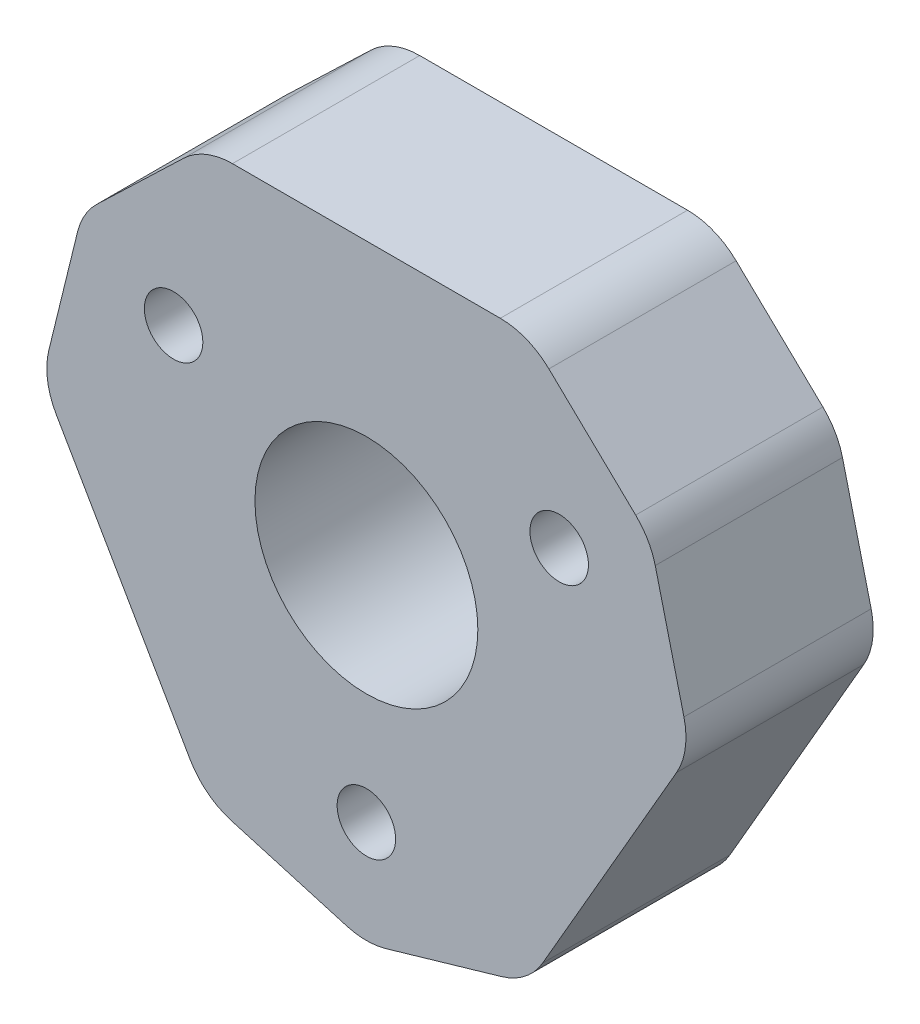
ISO-10303-21;
HEADER;
FILE_DESCRIPTION(('STEP AP214'),'2;1');
FILE_NAME('part.step','',(''),(''),'','','');
FILE_SCHEMA(('AUTOMOTIVE_DESIGN { 1 0 10303 214 1 1 1 1 }'));
ENDSEC;
DATA;
#1=APPLICATION_CONTEXT('core data for automotive mechanical design processes');
#2=APPLICATION_PROTOCOL_DEFINITION('international standard','automotive_design',2000,#1);
#3=PRODUCT_CONTEXT('',#1,'mechanical');
#4=PRODUCT('Part','Part','',(#3));
#5=PRODUCT_RELATED_PRODUCT_CATEGORY('part','',(#4));
#6=PRODUCT_DEFINITION_FORMATION('','',#4);
#7=PRODUCT_DEFINITION_CONTEXT('part definition',#1,'design');
#8=PRODUCT_DEFINITION('design','',#6,#7);
#9=PRODUCT_DEFINITION_SHAPE('','',#8);
#10=(LENGTH_UNIT() NAMED_UNIT(*) SI_UNIT(.MILLI.,.METRE.));
#11=(NAMED_UNIT(*) PLANE_ANGLE_UNIT() SI_UNIT($,.RADIAN.));
#12=(NAMED_UNIT(*) SI_UNIT($,.STERADIAN.) SOLID_ANGLE_UNIT());
#13=UNCERTAINTY_MEASURE_WITH_UNIT(LENGTH_MEASURE(1.E-05),#10,'distance_accuracy_value','');
#14=(GEOMETRIC_REPRESENTATION_CONTEXT(3) GLOBAL_UNCERTAINTY_ASSIGNED_CONTEXT((#13)) GLOBAL_UNIT_ASSIGNED_CONTEXT((#10,
#11,#12)) REPRESENTATION_CONTEXT('',''));
#15=CARTESIAN_POINT('',(0.,0.,0.));
#16=DIRECTION('',(0.,0.,1.));
#17=DIRECTION('',(1.,0.,0.));
#18=AXIS2_PLACEMENT_3D('',#15,#16,#17);
#19=CARTESIAN_POINT('',(0.,-10.888495471054,8.));
#20=DIRECTION('',(0.,0.,1.));
#21=DIRECTION('',(1.,0.,0.));
#22=AXIS2_PLACEMENT_3D('',#19,#20,#21);
#23=PLANE('',#22);
#24=CARTESIAN_POINT('',(8.23806665349945,4.75625000000004,8.));
#25=DIRECTION('',(0.,0.,1.));
#26=DIRECTION('',(1.,0.,0.));
#27=AXIS2_PLACEMENT_3D('',#24,#25,#26);
#28=CIRCLE('',#27,1.25);
#29=CARTESIAN_POINT('',(9.48806665349945,4.75625000000004,8.));
#30=VERTEX_POINT('',#29);
#31=EDGE_CURVE('E381',#30,#30,#28,.T.);
#32=ORIENTED_EDGE('',*,*,#31,.F.);
#33=EDGE_LOOP('',(#32));
#34=FACE_BOUND('',#33,.T.);
#35=CARTESIAN_POINT('',(0.,0.,8.));
#36=DIRECTION('',(0.,0.,1.));
#37=DIRECTION('',(1.,0.,0.));
#38=AXIS2_PLACEMENT_3D('',#35,#36,#37);
#39=CIRCLE('',#38,4.7625);
#40=CARTESIAN_POINT('',(4.7625,0.,8.));
#41=VERTEX_POINT('',#40);
#42=EDGE_CURVE('E206',#41,#41,#39,.T.);
#43=ORIENTED_EDGE('',*,*,#42,.F.);
#44=EDGE_LOOP('',(#43));
#45=FACE_BOUND('',#44,.T.);
#46=CARTESIAN_POINT('',(0.,-10.888495471054,8.));
#47=DIRECTION('',(0.,0.,1.));
#48=DIRECTION('',(1.,0.,0.));
#49=AXIS2_PLACEMENT_3D('',#46,#47,#48);
#50=CIRCLE('',#49,3.);
#51=CARTESIAN_POINT('',(-0.836847118322304,-13.7694131895173,8.));
#52=VERTEX_POINT('',#51);
#53=CARTESIAN_POINT('',(0.836847118322307,-13.7694131895173,8.));
#54=VERTEX_POINT('',#53);
#55=EDGE_CURVE('E237',#52,#54,#50,.T.);
#56=ORIENTED_EDGE('',*,*,#55,.T.);
#57=DIRECTION('',(0.960305906154426,0.278949039440768,0.));
#58=VECTOR('',#57,1.);
#59=CARTESIAN_POINT('',(0.836847118322307,-13.7694131895173,8.));
#60=LINE('',#59,#58);
#61=CARTESIAN_POINT('',(5.77000843492431,-12.3364316761752,8.));
#62=VERTEX_POINT('',#61);
#63=EDGE_CURVE('E135',#54,#62,#60,.T.);
#64=ORIENTED_EDGE('',*,*,#63,.T.);
#65=CARTESIAN_POINT('',(4.933161316602,-9.45551395771196,8.));
#66=DIRECTION('',(0.,0.,1.));
#67=DIRECTION('',(1.,0.,0.));
#68=AXIS2_PLACEMENT_3D('',#65,#66,#67);
#69=CIRCLE('',#68,3.);
#70=CARTESIAN_POINT('',(7.53123752795532,-10.955513957712,8.));
#71=VERTEX_POINT('',#70);
#72=EDGE_CURVE('E282',#62,#71,#69,.T.);
#73=ORIENTED_EDGE('',*,*,#72,.T.);
#74=DIRECTION('',(0.5,0.866025403784439,0.));
#75=VECTOR('',#74,1.);
#76=CARTESIAN_POINT('',(7.53123752795532,-10.955513957712,8.));
#77=LINE('',#76,#75);
#78=CARTESIAN_POINT('',(13.2533721628712,-1.04448604228803,8.));
#79=VERTEX_POINT('',#78);
#80=EDGE_CURVE('E301',#71,#79,#77,.T.);
#81=ORIENTED_EDGE('',*,*,#80,.T.);
#82=CARTESIAN_POINT('',(10.6552959515179,0.455513957711965,8.));
#83=DIRECTION('',(0.,0.,1.));
#84=DIRECTION('',(1.,0.,0.));
#85=AXIS2_PLACEMENT_3D('',#82,#83,#84);
#86=CIRCLE('',#85,3.);
#87=CARTESIAN_POINT('',(13.568667441081,1.17124195339269,8.));
#88=VERTEX_POINT('',#87);
#89=EDGE_CURVE('E298',#79,#88,#86,.T.);
#90=ORIENTED_EDGE('',*,*,#89,.T.);
#91=DIRECTION('',(-0.238575998560241,0.971123829854352,0.));
#92=VECTOR('',#91,1.);
#93=CARTESIAN_POINT('',(12.3430851764876,6.15997573120773,8.));
#94=LINE('',#93,#92);
#95=CARTESIAN_POINT('',(12.3430851764876,6.15997573120773,8.));
#96=VERTEX_POINT('',#95);
#97=EDGE_CURVE('E300',#88,#96,#94,.T.);
#98=ORIENTED_EDGE('',*,*,#97,.T.);
#99=CARTESIAN_POINT('',(9.42971368692458,5.44424773552701,8.));
#100=DIRECTION('',(0.,0.,1.));
#101=DIRECTION('',(-1.,0.,0.));
#102=AXIS2_PLACEMENT_3D('',#99,#100,#101);
#103=CIRCLE('',#102,3.);
#104=CARTESIAN_POINT('',(11.5062380581653,7.60943745830957,8.));
#105=VERTEX_POINT('',#104);
#106=EDGE_CURVE('E303',#96,#105,#103,.T.);
#107=ORIENTED_EDGE('',*,*,#106,.T.);
#108=DIRECTION('',(-0.721729907594186,0.692174790413584,0.));
#109=VECTOR('',#108,1.);
#110=CARTESIAN_POINT('',(7.79865900615664,11.1651897227826,8.));
#111=LINE('',#110,#109);
#112=CARTESIAN_POINT('',(7.79865900615664,11.1651897227826,8.));
#113=VERTEX_POINT('',#112);
#114=EDGE_CURVE('E309',#105,#113,#111,.T.);
#115=ORIENTED_EDGE('',*,*,#114,.T.);
#116=CARTESIAN_POINT('',(5.72213463491589,9.,8.));
#117=DIRECTION('',(0.,0.,1.));
#118=DIRECTION('',(1.,0.,0.));
#119=AXIS2_PLACEMENT_3D('',#116,#117,#118);
#120=CIRCLE('',#119,3.);
#121=CARTESIAN_POINT('',(5.72213463491589,12.,8.));
#122=VERTEX_POINT('',#121);
#123=EDGE_CURVE('E311',#113,#122,#120,.T.);
#124=ORIENTED_EDGE('',*,*,#123,.T.);
#125=DIRECTION('',(-1.,0.,0.));
#126=VECTOR('',#125,1.);
#127=CARTESIAN_POINT('',(5.72213463491589,12.,8.));
#128=LINE('',#127,#126);
#129=CARTESIAN_POINT('',(-5.72213463491589,12.,8.));
#130=VERTEX_POINT('',#129);
#131=EDGE_CURVE('E313',#122,#130,#128,.T.);
#132=ORIENTED_EDGE('',*,*,#131,.T.);
#133=CARTESIAN_POINT('',(-5.72213463491589,9.,8.));
#134=DIRECTION('',(0.,0.,1.));
#135=DIRECTION('',(1.,0.,0.));
#136=AXIS2_PLACEMENT_3D('',#133,#134,#135);
#137=CIRCLE('',#136,3.);
#138=CARTESIAN_POINT('',(-7.79865900615665,11.1651897227826,8.));
#139=VERTEX_POINT('',#138);
#140=EDGE_CURVE('E315',#130,#139,#137,.T.);
#141=ORIENTED_EDGE('',*,*,#140,.T.);
#142=DIRECTION('',(-0.721729907594183,-0.692174790413587,0.));
#143=VECTOR('',#142,1.);
#144=CARTESIAN_POINT('',(-7.79865900615665,11.1651897227826,8.));
#145=LINE('',#144,#143);
#146=CARTESIAN_POINT('',(-11.5062380581653,7.60943745830954,8.));
#147=VERTEX_POINT('',#146);
#148=EDGE_CURVE('E317',#139,#147,#145,.T.);
#149=ORIENTED_EDGE('',*,*,#148,.T.);
#150=CARTESIAN_POINT('',(-9.42971368692457,5.44424773552699,8.));
#151=DIRECTION('',(0.,0.,1.));
#152=DIRECTION('',(1.,0.,0.));
#153=AXIS2_PLACEMENT_3D('',#150,#151,#152);
#154=CIRCLE('',#153,3.);
#155=CARTESIAN_POINT('',(-12.3430851764876,6.15997573120772,8.));
#156=VERTEX_POINT('',#155);
#157=EDGE_CURVE('E319',#147,#156,#154,.T.);
#158=ORIENTED_EDGE('',*,*,#157,.T.);
#159=DIRECTION('',(-0.238575998560243,-0.971123829854351,0.));
#160=VECTOR('',#159,1.);
#161=CARTESIAN_POINT('',(-12.3430851764876,6.15997573120772,8.));
#162=LINE('',#161,#160);
#163=CARTESIAN_POINT('',(-13.5686674410809,1.17124195339268,8.));
#164=VERTEX_POINT('',#163);
#165=EDGE_CURVE('E321',#156,#164,#162,.T.);
#166=ORIENTED_EDGE('',*,*,#165,.T.);
#167=CARTESIAN_POINT('',(-10.6552959515179,0.455513957711953,8.));
#168=DIRECTION('',(0.,0.,1.));
#169=DIRECTION('',(-1.,0.,0.));
#170=AXIS2_PLACEMENT_3D('',#167,#168,#169);
#171=CIRCLE('',#170,3.);
#172=CARTESIAN_POINT('',(-13.2533721628712,-1.04448604228805,8.));
#173=VERTEX_POINT('',#172);
#174=EDGE_CURVE('E184',#164,#173,#171,.T.);
#175=ORIENTED_EDGE('',*,*,#174,.T.);
#176=DIRECTION('',(0.5,-0.866025403784438,0.));
#177=VECTOR('',#176,1.);
#178=CARTESIAN_POINT('',(-13.2533721628712,-1.04448604228805,8.));
#179=LINE('',#178,#177);
#180=CARTESIAN_POINT('',(-7.53123752795531,-10.955513957712,8.));
#181=VERTEX_POINT('',#180);
#182=EDGE_CURVE('E178',#173,#181,#179,.T.);
#183=ORIENTED_EDGE('',*,*,#182,.T.);
#184=CARTESIAN_POINT('',(-4.933161316602,-9.45551395771196,8.));
#185=DIRECTION('',(0.,0.,1.));
#186=DIRECTION('',(1.,0.,0.));
#187=AXIS2_PLACEMENT_3D('',#184,#185,#186);
#188=CIRCLE('',#187,3.);
#189=CARTESIAN_POINT('',(-5.7700084349243,-12.3364316761752,8.));
#190=VERTEX_POINT('',#189);
#191=EDGE_CURVE('E182',#181,#190,#188,.T.);
#192=ORIENTED_EDGE('',*,*,#191,.T.);
#193=DIRECTION('',(0.960305906154425,-0.278949039440769,0.));
#194=VECTOR('',#193,1.);
#195=CARTESIAN_POINT('',(-5.7700084349243,-12.3364316761752,8.));
#196=LINE('',#195,#194);
#197=EDGE_CURVE('E62',#190,#52,#196,.T.);
#198=ORIENTED_EDGE('',*,*,#197,.T.);
#199=EDGE_LOOP('',(#56,#64,#73,#81,#90,#98,#107,#115,#124,#132,#141,#149,#158,#166,#175,#183,
#192,#198));
#200=FACE_BOUND('',#199,.T.);
#201=CARTESIAN_POINT('',(-8.23806665349949,4.75624999999998,8.));
#202=DIRECTION('',(0.,0.,1.));
#203=DIRECTION('',(1.,0.,0.));
#204=AXIS2_PLACEMENT_3D('',#201,#202,#203);
#205=CIRCLE('',#204,1.25);
#206=CARTESIAN_POINT('',(-6.98806665349949,4.75624999999998,8.));
#207=VERTEX_POINT('',#206);
#208=EDGE_CURVE('E387',#207,#207,#205,.T.);
#209=ORIENTED_EDGE('',*,*,#208,.F.);
#210=EDGE_LOOP('',(#209));
#211=FACE_BOUND('',#210,.T.);
#212=CARTESIAN_POINT('',(0.,-9.5125,8.));
#213=DIRECTION('',(0.,0.,1.));
#214=DIRECTION('',(1.,0.,0.));
#215=AXIS2_PLACEMENT_3D('',#212,#213,#214);
#216=CIRCLE('',#215,1.25);
#217=CARTESIAN_POINT('',(1.25,-9.5125,8.));
#218=VERTEX_POINT('',#217);
#219=EDGE_CURVE('E372',#218,#218,#216,.T.);
#220=ORIENTED_EDGE('',*,*,#219,.F.);
#221=EDGE_LOOP('',(#220));
#222=FACE_BOUND('',#221,.T.);
#223=ADVANCED_FACE('F45',(#34,#45,#200,#211,#222),#23,.T.);
#224=CARTESIAN_POINT('',(0.,-10.888495471054,0.));
#225=DIRECTION('',(0.,0.,1.));
#226=DIRECTION('',(1.,0.,0.));
#227=AXIS2_PLACEMENT_3D('',#224,#225,#226);
#228=PLANE('',#227);
#229=CARTESIAN_POINT('',(0.,-10.888495471054,0.));
#230=DIRECTION('',(0.,0.,1.));
#231=DIRECTION('',(1.,0.,0.));
#232=AXIS2_PLACEMENT_3D('',#229,#230,#231);
#233=CIRCLE('',#232,3.);
#234=CARTESIAN_POINT('',(-0.836847118322304,-13.7694131895173,0.));
#235=VERTEX_POINT('',#234);
#236=CARTESIAN_POINT('',(0.836847118322307,-13.7694131895173,0.));
#237=VERTEX_POINT('',#236);
#238=EDGE_CURVE('E202',#235,#237,#233,.T.);
#239=ORIENTED_EDGE('',*,*,#238,.F.);
#240=DIRECTION('',(0.960305906154425,-0.278949039440769,0.));
#241=VECTOR('',#240,1.);
#242=CARTESIAN_POINT('',(-5.7700084349243,-12.3364316761752,0.));
#243=LINE('',#242,#241);
#244=CARTESIAN_POINT('',(-5.7700084349243,-12.3364316761752,0.));
#245=VERTEX_POINT('',#244);
#246=EDGE_CURVE('E127',#245,#235,#243,.T.);
#247=ORIENTED_EDGE('',*,*,#246,.F.);
#248=CARTESIAN_POINT('',(-4.933161316602,-9.45551395771196,0.));
#249=DIRECTION('',(0.,0.,1.));
#250=DIRECTION('',(1.,0.,0.));
#251=AXIS2_PLACEMENT_3D('',#248,#249,#250);
#252=CIRCLE('',#251,3.);
#253=CARTESIAN_POINT('',(-7.53123752795531,-10.955513957712,0.));
#254=VERTEX_POINT('',#253);
#255=EDGE_CURVE('E121',#254,#245,#252,.T.);
#256=ORIENTED_EDGE('',*,*,#255,.F.);
#257=DIRECTION('',(0.5,-0.866025403784438,0.));
#258=VECTOR('',#257,1.);
#259=CARTESIAN_POINT('',(-13.2533721628712,-1.04448604228805,0.));
#260=LINE('',#259,#258);
#261=CARTESIAN_POINT('',(-13.2533721628712,-1.04448604228805,0.));
#262=VERTEX_POINT('',#261);
#263=EDGE_CURVE('E192',#262,#254,#260,.T.);
#264=ORIENTED_EDGE('',*,*,#263,.F.);
#265=CARTESIAN_POINT('',(-10.6552959515179,0.455513957711953,0.));
#266=DIRECTION('',(0.,0.,1.));
#267=DIRECTION('',(-1.,0.,0.));
#268=AXIS2_PLACEMENT_3D('',#265,#266,#267);
#269=CIRCLE('',#268,3.);
#270=CARTESIAN_POINT('',(-13.5686674410809,1.17124195339268,0.));
#271=VERTEX_POINT('',#270);
#272=EDGE_CURVE('E232',#271,#262,#269,.T.);
#273=ORIENTED_EDGE('',*,*,#272,.F.);
#274=DIRECTION('',(-0.238575998560243,-0.971123829854351,0.));
#275=VECTOR('',#274,1.);
#276=CARTESIAN_POINT('',(-12.3430851764876,6.15997573120772,0.));
#277=LINE('',#276,#275);
#278=CARTESIAN_POINT('',(-12.3430851764876,6.15997573120772,0.));
#279=VERTEX_POINT('',#278);
#280=EDGE_CURVE('E230',#279,#271,#277,.T.);
#281=ORIENTED_EDGE('',*,*,#280,.F.);
#282=CARTESIAN_POINT('',(-9.42971368692457,5.44424773552699,0.));
#283=DIRECTION('',(0.,0.,1.));
#284=DIRECTION('',(1.,0.,0.));
#285=AXIS2_PLACEMENT_3D('',#282,#283,#284);
#286=CIRCLE('',#285,3.);
#287=CARTESIAN_POINT('',(-11.5062380581653,7.60943745830954,0.));
#288=VERTEX_POINT('',#287);
#289=EDGE_CURVE('E228',#288,#279,#286,.T.);
#290=ORIENTED_EDGE('',*,*,#289,.F.);
#291=DIRECTION('',(-0.721729907594183,-0.692174790413587,0.));
#292=VECTOR('',#291,1.);
#293=CARTESIAN_POINT('',(-7.79865900615665,11.1651897227826,0.));
#294=LINE('',#293,#292);
#295=CARTESIAN_POINT('',(-7.79865900615665,11.1651897227826,0.));
#296=VERTEX_POINT('',#295);
#297=EDGE_CURVE('E226',#296,#288,#294,.T.);
#298=ORIENTED_EDGE('',*,*,#297,.F.);
#299=CARTESIAN_POINT('',(-5.72213463491589,9.,0.));
#300=DIRECTION('',(0.,0.,1.));
#301=DIRECTION('',(1.,0.,0.));
#302=AXIS2_PLACEMENT_3D('',#299,#300,#301);
#303=CIRCLE('',#302,3.);
#304=CARTESIAN_POINT('',(-5.72213463491589,12.,0.));
#305=VERTEX_POINT('',#304);
#306=EDGE_CURVE('E224',#305,#296,#303,.T.);
#307=ORIENTED_EDGE('',*,*,#306,.F.);
#308=DIRECTION('',(-1.,0.,0.));
#309=VECTOR('',#308,1.);
#310=CARTESIAN_POINT('',(5.72213463491589,12.,0.));
#311=LINE('',#310,#309);
#312=CARTESIAN_POINT('',(5.72213463491589,12.,0.));
#313=VERTEX_POINT('',#312);
#314=EDGE_CURVE('E222',#313,#305,#311,.T.);
#315=ORIENTED_EDGE('',*,*,#314,.F.);
#316=CARTESIAN_POINT('',(5.72213463491589,9.,0.));
#317=DIRECTION('',(0.,0.,1.));
#318=DIRECTION('',(1.,0.,0.));
#319=AXIS2_PLACEMENT_3D('',#316,#317,#318);
#320=CIRCLE('',#319,3.);
#321=CARTESIAN_POINT('',(7.79865900615664,11.1651897227826,0.));
#322=VERTEX_POINT('',#321);
#323=EDGE_CURVE('E220',#322,#313,#320,.T.);
#324=ORIENTED_EDGE('',*,*,#323,.F.);
#325=DIRECTION('',(-0.721729907594186,0.692174790413584,0.));
#326=VECTOR('',#325,1.);
#327=CARTESIAN_POINT('',(7.79865900615664,11.1651897227826,0.));
#328=LINE('',#327,#326);
#329=CARTESIAN_POINT('',(11.5062380581653,7.60943745830957,0.));
#330=VERTEX_POINT('',#329);
#331=EDGE_CURVE('E218',#330,#322,#328,.T.);
#332=ORIENTED_EDGE('',*,*,#331,.F.);
#333=CARTESIAN_POINT('',(9.42971368692458,5.44424773552701,0.));
#334=DIRECTION('',(0.,0.,1.));
#335=DIRECTION('',(-1.,0.,0.));
#336=AXIS2_PLACEMENT_3D('',#333,#334,#335);
#337=CIRCLE('',#336,3.);
#338=CARTESIAN_POINT('',(12.3430851764876,6.15997573120773,0.));
#339=VERTEX_POINT('',#338);
#340=EDGE_CURVE('E216',#339,#330,#337,.T.);
#341=ORIENTED_EDGE('',*,*,#340,.F.);
#342=DIRECTION('',(-0.238575998560241,0.971123829854352,0.));
#343=VECTOR('',#342,1.);
#344=CARTESIAN_POINT('',(12.3430851764876,6.15997573120773,0.));
#345=LINE('',#344,#343);
#346=CARTESIAN_POINT('',(13.568667441081,1.17124195339269,0.));
#347=VERTEX_POINT('',#346);
#348=EDGE_CURVE('E214',#347,#339,#345,.T.);
#349=ORIENTED_EDGE('',*,*,#348,.F.);
#350=CARTESIAN_POINT('',(10.6552959515179,0.455513957711965,0.));
#351=DIRECTION('',(0.,0.,1.));
#352=DIRECTION('',(1.,0.,0.));
#353=AXIS2_PLACEMENT_3D('',#350,#351,#352);
#354=CIRCLE('',#353,3.);
#355=CARTESIAN_POINT('',(13.2533721628712,-1.04448604228803,0.));
#356=VERTEX_POINT('',#355);
#357=EDGE_CURVE('E212',#356,#347,#354,.T.);
#358=ORIENTED_EDGE('',*,*,#357,.F.);
#359=DIRECTION('',(0.5,0.866025403784439,0.));
#360=VECTOR('',#359,1.);
#361=CARTESIAN_POINT('',(7.53123752795532,-10.955513957712,0.));
#362=LINE('',#361,#360);
#363=CARTESIAN_POINT('',(7.53123752795532,-10.955513957712,0.));
#364=VERTEX_POINT('',#363);
#365=EDGE_CURVE('E210',#364,#356,#362,.T.);
#366=ORIENTED_EDGE('',*,*,#365,.F.);
#367=CARTESIAN_POINT('',(4.933161316602,-9.45551395771196,0.));
#368=DIRECTION('',(0.,0.,1.));
#369=DIRECTION('',(1.,0.,0.));
#370=AXIS2_PLACEMENT_3D('',#367,#368,#369);
#371=CIRCLE('',#370,3.);
#372=CARTESIAN_POINT('',(5.77000843492431,-12.3364316761752,0.));
#373=VERTEX_POINT('',#372);
#374=EDGE_CURVE('E208',#373,#364,#371,.T.);
#375=ORIENTED_EDGE('',*,*,#374,.F.);
#376=DIRECTION('',(0.960305906154426,0.278949039440768,0.));
#377=VECTOR('',#376,1.);
#378=CARTESIAN_POINT('',(0.836847118322307,-13.7694131895173,0.));
#379=LINE('',#378,#377);
#380=EDGE_CURVE('E205',#237,#373,#379,.T.);
#381=ORIENTED_EDGE('',*,*,#380,.F.);
#382=EDGE_LOOP('',(#239,#247,#256,#264,#273,#281,#290,#298,#307,#315,#324,#332,#341,#349,#358,
#366,#375,#381));
#383=FACE_BOUND('',#382,.T.);
#384=CARTESIAN_POINT('',(0.,0.,0.));
#385=DIRECTION('',(0.,0.,1.));
#386=DIRECTION('',(1.,0.,0.));
#387=AXIS2_PLACEMENT_3D('',#384,#385,#386);
#388=CIRCLE('',#387,4.7625);
#389=CARTESIAN_POINT('',(4.7625,0.,0.));
#390=VERTEX_POINT('',#389);
#391=EDGE_CURVE('E390',#390,#390,#388,.T.);
#392=ORIENTED_EDGE('',*,*,#391,.T.);
#393=EDGE_LOOP('',(#392));
#394=FACE_BOUND('',#393,.T.);
#395=CARTESIAN_POINT('',(-8.23806665349949,4.75624999999998,0.));
#396=DIRECTION('',(0.,0.,1.));
#397=DIRECTION('',(1.,0.,0.));
#398=AXIS2_PLACEMENT_3D('',#395,#396,#397);
#399=CIRCLE('',#398,1.25);
#400=CARTESIAN_POINT('',(-6.98806665349949,4.75624999999998,0.));
#401=VERTEX_POINT('',#400);
#402=EDGE_CURVE('E384',#401,#401,#399,.T.);
#403=ORIENTED_EDGE('',*,*,#402,.T.);
#404=EDGE_LOOP('',(#403));
#405=FACE_BOUND('',#404,.T.);
#406=CARTESIAN_POINT('',(8.23806665349945,4.75625000000004,0.));
#407=DIRECTION('',(0.,0.,1.));
#408=DIRECTION('',(1.,0.,0.));
#409=AXIS2_PLACEMENT_3D('',#406,#407,#408);
#410=CIRCLE('',#409,1.25);
#411=CARTESIAN_POINT('',(9.48806665349945,4.75625000000004,0.));
#412=VERTEX_POINT('',#411);
#413=EDGE_CURVE('E378',#412,#412,#410,.T.);
#414=ORIENTED_EDGE('',*,*,#413,.T.);
#415=EDGE_LOOP('',(#414));
#416=FACE_BOUND('',#415,.T.);
#417=CARTESIAN_POINT('',(0.,-9.5125,0.));
#418=DIRECTION('',(0.,0.,1.));
#419=DIRECTION('',(1.,0.,0.));
#420=AXIS2_PLACEMENT_3D('',#417,#418,#419);
#421=CIRCLE('',#420,1.25);
#422=CARTESIAN_POINT('',(1.25,-9.5125,0.));
#423=VERTEX_POINT('',#422);
#424=EDGE_CURVE('E375',#423,#423,#421,.T.);
#425=ORIENTED_EDGE('',*,*,#424,.T.);
#426=EDGE_LOOP('',(#425));
#427=FACE_BOUND('',#426,.T.);
#428=ADVANCED_FACE('F286',(#383,#394,#405,#416,#427),#228,.F.);
#429=CARTESIAN_POINT('',(0.,-10.888495471054,8.));
#430=DIRECTION('',(0.,0.,-1.));
#431=DIRECTION('',(-1.,0.,0.));
#432=AXIS2_PLACEMENT_3D('',#429,#430,#431);
#433=CYLINDRICAL_SURFACE('',#432,3.);
#434=ORIENTED_EDGE('',*,*,#238,.T.);
#435=DIRECTION('',(0.,0.,-1.));
#436=VECTOR('',#435,1.);
#437=CARTESIAN_POINT('',(0.836847118322307,-13.7694131895173,8.));
#438=LINE('',#437,#436);
#439=EDGE_CURVE('E11',#54,#237,#438,.T.);
#440=ORIENTED_EDGE('',*,*,#439,.F.);
#441=ORIENTED_EDGE('',*,*,#55,.F.);
#442=DIRECTION('',(0.,0.,-1.));
#443=VECTOR('',#442,1.);
#444=CARTESIAN_POINT('',(-0.836847118322304,-13.7694131895173,8.));
#445=LINE('',#444,#443);
#446=EDGE_CURVE('E198',#52,#235,#445,.T.);
#447=ORIENTED_EDGE('',*,*,#446,.T.);
#448=EDGE_LOOP('',(#434,#440,#441,#447));
#449=FACE_BOUND('',#448,.T.);
#450=ADVANCED_FACE('F47',(#449),#433,.T.);
#451=CARTESIAN_POINT('',(0.836847118322307,-13.7694131895173,8.));
#452=DIRECTION('',(-0.278949039440768,0.960305906154426,0.));
#453=DIRECTION('',(-0.960305906154426,-0.278949039440768,0.));
#454=AXIS2_PLACEMENT_3D('',#451,#452,#453);
#455=PLANE('',#454);
#456=ORIENTED_EDGE('',*,*,#380,.T.);
#457=DIRECTION('',(0.,0.,-1.));
#458=VECTOR('',#457,1.);
#459=CARTESIAN_POINT('',(5.77000843492431,-12.3364316761752,8.));
#460=LINE('',#459,#458);
#461=EDGE_CURVE('E54',#62,#373,#460,.T.);
#462=ORIENTED_EDGE('',*,*,#461,.F.);
#463=ORIENTED_EDGE('',*,*,#63,.F.);
#464=ORIENTED_EDGE('',*,*,#439,.T.);
#465=EDGE_LOOP('',(#456,#462,#463,#464));
#466=FACE_BOUND('',#465,.T.);
#467=ADVANCED_FACE('F564',(#466),#455,.F.);
#468=CARTESIAN_POINT('',(4.933161316602,-9.45551395771196,8.));
#469=DIRECTION('',(0.,0.,-1.));
#470=DIRECTION('',(-1.,0.,0.));
#471=AXIS2_PLACEMENT_3D('',#468,#469,#470);
#472=CYLINDRICAL_SURFACE('',#471,3.);
#473=ORIENTED_EDGE('',*,*,#374,.T.);
#474=DIRECTION('',(0.,0.,-1.));
#475=VECTOR('',#474,1.);
#476=CARTESIAN_POINT('',(7.53123752795532,-10.955513957712,8.));
#477=LINE('',#476,#475);
#478=EDGE_CURVE('E274',#71,#364,#477,.T.);
#479=ORIENTED_EDGE('',*,*,#478,.F.);
#480=ORIENTED_EDGE('',*,*,#72,.F.);
#481=ORIENTED_EDGE('',*,*,#461,.T.);
#482=EDGE_LOOP('',(#473,#479,#480,#481));
#483=FACE_BOUND('',#482,.T.);
#484=ADVANCED_FACE('F280',(#483),#472,.T.);
#485=CARTESIAN_POINT('',(7.53123752795532,-10.955513957712,8.));
#486=DIRECTION('',(-0.866025403784439,0.5,0.));
#487=DIRECTION('',(-0.5,-0.866025403784439,0.));
#488=AXIS2_PLACEMENT_3D('',#485,#486,#487);
#489=PLANE('',#488);
#490=ORIENTED_EDGE('',*,*,#365,.T.);
#491=DIRECTION('',(0.,0.,-1.));
#492=VECTOR('',#491,1.);
#493=CARTESIAN_POINT('',(13.2533721628712,-1.04448604228803,8.));
#494=LINE('',#493,#492);
#495=EDGE_CURVE('E271',#79,#356,#494,.T.);
#496=ORIENTED_EDGE('',*,*,#495,.F.);
#497=ORIENTED_EDGE('',*,*,#80,.F.);
#498=ORIENTED_EDGE('',*,*,#478,.T.);
#499=EDGE_LOOP('',(#490,#496,#497,#498));
#500=FACE_BOUND('',#499,.T.);
#501=ADVANCED_FACE('F292',(#500),#489,.F.);
#502=CARTESIAN_POINT('',(10.6552959515179,0.455513957711965,8.));
#503=DIRECTION('',(0.,0.,-1.));
#504=DIRECTION('',(-1.,0.,0.));
#505=AXIS2_PLACEMENT_3D('',#502,#503,#504);
#506=CYLINDRICAL_SURFACE('',#505,3.);
#507=ORIENTED_EDGE('',*,*,#357,.T.);
#508=DIRECTION('',(0.,0.,-1.));
#509=VECTOR('',#508,1.);
#510=CARTESIAN_POINT('',(13.568667441081,1.17124195339269,8.));
#511=LINE('',#510,#509);
#512=EDGE_CURVE('E268',#88,#347,#511,.T.);
#513=ORIENTED_EDGE('',*,*,#512,.F.);
#514=ORIENTED_EDGE('',*,*,#89,.F.);
#515=ORIENTED_EDGE('',*,*,#495,.T.);
#516=EDGE_LOOP('',(#507,#513,#514,#515));
#517=FACE_BOUND('',#516,.T.);
#518=ADVANCED_FACE('F296',(#517),#506,.T.);
#519=CARTESIAN_POINT('',(12.3430851764876,6.15997573120773,8.));
#520=DIRECTION('',(-0.971123829854352,-0.238575998560241,0.));
#521=DIRECTION('',(0.238575998560241,-0.971123829854352,0.));
#522=AXIS2_PLACEMENT_3D('',#519,#520,#521);
#523=PLANE('',#522);
#524=ORIENTED_EDGE('',*,*,#348,.T.);
#525=DIRECTION('',(0.,0.,-1.));
#526=VECTOR('',#525,1.);
#527=CARTESIAN_POINT('',(12.3430851764876,6.15997573120773,8.));
#528=LINE('',#527,#526);
#529=EDGE_CURVE('E265',#96,#339,#528,.T.);
#530=ORIENTED_EDGE('',*,*,#529,.F.);
#531=ORIENTED_EDGE('',*,*,#97,.F.);
#532=ORIENTED_EDGE('',*,*,#512,.T.);
#533=EDGE_LOOP('',(#524,#530,#531,#532));
#534=FACE_BOUND('',#533,.T.);
#535=ADVANCED_FACE('F529',(#534),#523,.F.);
#536=CARTESIAN_POINT('',(9.42971368692458,5.44424773552701,8.));
#537=DIRECTION('',(0.,0.,-1.));
#538=DIRECTION('',(-1.,0.,0.));
#539=AXIS2_PLACEMENT_3D('',#536,#537,#538);
#540=CYLINDRICAL_SURFACE('',#539,3.);
#541=ORIENTED_EDGE('',*,*,#340,.T.);
#542=DIRECTION('',(0.,0.,-1.));
#543=VECTOR('',#542,1.);
#544=CARTESIAN_POINT('',(11.5062380581653,7.60943745830957,8.));
#545=LINE('',#544,#543);
#546=EDGE_CURVE('E262',#105,#330,#545,.T.);
#547=ORIENTED_EDGE('',*,*,#546,.F.);
#548=ORIENTED_EDGE('',*,*,#106,.F.);
#549=ORIENTED_EDGE('',*,*,#529,.T.);
#550=EDGE_LOOP('',(#541,#547,#548,#549));
#551=FACE_BOUND('',#550,.T.);
#552=ADVANCED_FACE('F519',(#551),#540,.T.);
#553=CARTESIAN_POINT('',(7.79865900615664,11.1651897227826,8.));
#554=DIRECTION('',(-0.692174790413584,-0.721729907594186,0.));
#555=DIRECTION('',(0.721729907594186,-0.692174790413584,0.));
#556=AXIS2_PLACEMENT_3D('',#553,#554,#555);
#557=PLANE('',#556);
#558=ORIENTED_EDGE('',*,*,#331,.T.);
#559=DIRECTION('',(0.,0.,-1.));
#560=VECTOR('',#559,1.);
#561=CARTESIAN_POINT('',(7.79865900615664,11.1651897227826,8.));
#562=LINE('',#561,#560);
#563=EDGE_CURVE('E259',#113,#322,#562,.T.);
#564=ORIENTED_EDGE('',*,*,#563,.F.);
#565=ORIENTED_EDGE('',*,*,#114,.F.);
#566=ORIENTED_EDGE('',*,*,#546,.T.);
#567=EDGE_LOOP('',(#558,#564,#565,#566));
#568=FACE_BOUND('',#567,.T.);
#569=ADVANCED_FACE('F509',(#568),#557,.F.);
#570=CARTESIAN_POINT('',(5.72213463491589,9.,8.));
#571=DIRECTION('',(0.,0.,-1.));
#572=DIRECTION('',(-1.,0.,0.));
#573=AXIS2_PLACEMENT_3D('',#570,#571,#572);
#574=CYLINDRICAL_SURFACE('',#573,3.);
#575=ORIENTED_EDGE('',*,*,#323,.T.);
#576=DIRECTION('',(0.,0.,-1.));
#577=VECTOR('',#576,1.);
#578=CARTESIAN_POINT('',(5.72213463491589,12.,8.));
#579=LINE('',#578,#577);
#580=EDGE_CURVE('E256',#122,#313,#579,.T.);
#581=ORIENTED_EDGE('',*,*,#580,.F.);
#582=ORIENTED_EDGE('',*,*,#123,.F.);
#583=ORIENTED_EDGE('',*,*,#563,.T.);
#584=EDGE_LOOP('',(#575,#581,#582,#583));
#585=FACE_BOUND('',#584,.T.);
#586=ADVANCED_FACE('F499',(#585),#574,.T.);
#587=CARTESIAN_POINT('',(5.72213463491589,12.,8.));
#588=DIRECTION('',(0.,-1.,0.));
#589=DIRECTION('',(1.,0.,0.));
#590=AXIS2_PLACEMENT_3D('',#587,#588,#589);
#591=PLANE('',#590);
#592=ORIENTED_EDGE('',*,*,#314,.T.);
#593=DIRECTION('',(0.,0.,-1.));
#594=VECTOR('',#593,1.);
#595=CARTESIAN_POINT('',(-5.72213463491589,12.,8.));
#596=LINE('',#595,#594);
#597=EDGE_CURVE('E253',#130,#305,#596,.T.);
#598=ORIENTED_EDGE('',*,*,#597,.F.);
#599=ORIENTED_EDGE('',*,*,#131,.F.);
#600=ORIENTED_EDGE('',*,*,#580,.T.);
#601=EDGE_LOOP('',(#592,#598,#599,#600));
#602=FACE_BOUND('',#601,.T.);
#603=ADVANCED_FACE('F489',(#602),#591,.F.);
#604=CARTESIAN_POINT('',(-5.72213463491589,9.,8.));
#605=DIRECTION('',(0.,0.,-1.));
#606=DIRECTION('',(-1.,0.,0.));
#607=AXIS2_PLACEMENT_3D('',#604,#605,#606);
#608=CYLINDRICAL_SURFACE('',#607,3.);
#609=ORIENTED_EDGE('',*,*,#306,.T.);
#610=DIRECTION('',(0.,0.,-1.));
#611=VECTOR('',#610,1.);
#612=CARTESIAN_POINT('',(-7.79865900615665,11.1651897227826,8.));
#613=LINE('',#612,#611);
#614=EDGE_CURVE('E250',#139,#296,#613,.T.);
#615=ORIENTED_EDGE('',*,*,#614,.F.);
#616=ORIENTED_EDGE('',*,*,#140,.F.);
#617=ORIENTED_EDGE('',*,*,#597,.T.);
#618=EDGE_LOOP('',(#609,#615,#616,#617));
#619=FACE_BOUND('',#618,.T.);
#620=ADVANCED_FACE('F479',(#619),#608,.T.);
#621=CARTESIAN_POINT('',(-7.79865900615665,11.1651897227826,8.));
#622=DIRECTION('',(0.692174790413587,-0.721729907594183,0.));
#623=DIRECTION('',(0.721729907594183,0.692174790413587,0.));
#624=AXIS2_PLACEMENT_3D('',#621,#622,#623);
#625=PLANE('',#624);
#626=ORIENTED_EDGE('',*,*,#297,.T.);
#627=DIRECTION('',(0.,0.,-1.));
#628=VECTOR('',#627,1.);
#629=CARTESIAN_POINT('',(-11.5062380581653,7.60943745830954,8.));
#630=LINE('',#629,#628);
#631=EDGE_CURVE('E247',#147,#288,#630,.T.);
#632=ORIENTED_EDGE('',*,*,#631,.F.);
#633=ORIENTED_EDGE('',*,*,#148,.F.);
#634=ORIENTED_EDGE('',*,*,#614,.T.);
#635=EDGE_LOOP('',(#626,#632,#633,#634));
#636=FACE_BOUND('',#635,.T.);
#637=ADVANCED_FACE('F469',(#636),#625,.F.);
#638=CARTESIAN_POINT('',(-9.42971368692457,5.44424773552699,8.));
#639=DIRECTION('',(0.,0.,-1.));
#640=DIRECTION('',(-1.,0.,0.));
#641=AXIS2_PLACEMENT_3D('',#638,#639,#640);
#642=CYLINDRICAL_SURFACE('',#641,3.);
#643=ORIENTED_EDGE('',*,*,#289,.T.);
#644=DIRECTION('',(0.,0.,-1.));
#645=VECTOR('',#644,1.);
#646=CARTESIAN_POINT('',(-12.3430851764876,6.15997573120772,8.));
#647=LINE('',#646,#645);
#648=EDGE_CURVE('E244',#156,#279,#647,.T.);
#649=ORIENTED_EDGE('',*,*,#648,.F.);
#650=ORIENTED_EDGE('',*,*,#157,.F.);
#651=ORIENTED_EDGE('',*,*,#631,.T.);
#652=EDGE_LOOP('',(#643,#649,#650,#651));
#653=FACE_BOUND('',#652,.T.);
#654=ADVANCED_FACE('F460',(#653),#642,.T.);
#655=CARTESIAN_POINT('',(-12.3430851764876,6.15997573120772,8.));
#656=DIRECTION('',(0.971123829854351,-0.238575998560243,0.));
#657=DIRECTION('',(0.238575998560243,0.971123829854351,0.));
#658=AXIS2_PLACEMENT_3D('',#655,#656,#657);
#659=PLANE('',#658);
#660=ORIENTED_EDGE('',*,*,#280,.T.);
#661=DIRECTION('',(0.,0.,-1.));
#662=VECTOR('',#661,1.);
#663=CARTESIAN_POINT('',(-13.5686674410809,1.17124195339268,8.));
#664=LINE('',#663,#662);
#665=EDGE_CURVE('E241',#164,#271,#664,.T.);
#666=ORIENTED_EDGE('',*,*,#665,.F.);
#667=ORIENTED_EDGE('',*,*,#165,.F.);
#668=ORIENTED_EDGE('',*,*,#648,.T.);
#669=EDGE_LOOP('',(#660,#666,#667,#668));
#670=FACE_BOUND('',#669,.T.);
#671=ADVANCED_FACE('F327',(#670),#659,.F.);
#672=CARTESIAN_POINT('',(-10.6552959515179,0.455513957711953,8.));
#673=DIRECTION('',(0.,0.,-1.));
#674=DIRECTION('',(-1.,0.,0.));
#675=AXIS2_PLACEMENT_3D('',#672,#673,#674);
#676=CYLINDRICAL_SURFACE('',#675,3.);
#677=ORIENTED_EDGE('',*,*,#272,.T.);
#678=DIRECTION('',(0.,0.,-1.));
#679=VECTOR('',#678,1.);
#680=CARTESIAN_POINT('',(-13.2533721628712,-1.04448604228805,8.));
#681=LINE('',#680,#679);
#682=EDGE_CURVE('E193',#173,#262,#681,.T.);
#683=ORIENTED_EDGE('',*,*,#682,.F.);
#684=ORIENTED_EDGE('',*,*,#174,.F.);
#685=ORIENTED_EDGE('',*,*,#665,.T.);
#686=EDGE_LOOP('',(#677,#683,#684,#685));
#687=FACE_BOUND('',#686,.T.);
#688=ADVANCED_FACE('F331',(#687),#676,.T.);
#689=CARTESIAN_POINT('',(-13.2533721628712,-1.04448604228805,8.));
#690=DIRECTION('',(0.866025403784439,0.5,0.));
#691=DIRECTION('',(-0.5,0.866025403784438,0.));
#692=AXIS2_PLACEMENT_3D('',#689,#690,#691);
#693=PLANE('',#692);
#694=ORIENTED_EDGE('',*,*,#263,.T.);
#695=DIRECTION('',(0.,0.,-1.));
#696=VECTOR('',#695,1.);
#697=CARTESIAN_POINT('',(-7.53123752795531,-10.955513957712,8.));
#698=LINE('',#697,#696);
#699=EDGE_CURVE('E189',#181,#254,#698,.T.);
#700=ORIENTED_EDGE('',*,*,#699,.F.);
#701=ORIENTED_EDGE('',*,*,#182,.F.);
#702=ORIENTED_EDGE('',*,*,#682,.T.);
#703=EDGE_LOOP('',(#694,#700,#701,#702));
#704=FACE_BOUND('',#703,.T.);
#705=ADVANCED_FACE('F190',(#704),#693,.F.);
#706=CARTESIAN_POINT('',(-4.933161316602,-9.45551395771196,8.));
#707=DIRECTION('',(0.,0.,-1.));
#708=DIRECTION('',(-1.,0.,0.));
#709=AXIS2_PLACEMENT_3D('',#706,#707,#708);
#710=CYLINDRICAL_SURFACE('',#709,3.);
#711=ORIENTED_EDGE('',*,*,#255,.T.);
#712=DIRECTION('',(0.,0.,-1.));
#713=VECTOR('',#712,1.);
#714=CARTESIAN_POINT('',(-5.7700084349243,-12.3364316761752,8.));
#715=LINE('',#714,#713);
#716=EDGE_CURVE('E194',#190,#245,#715,.T.);
#717=ORIENTED_EDGE('',*,*,#716,.F.);
#718=ORIENTED_EDGE('',*,*,#191,.F.);
#719=ORIENTED_EDGE('',*,*,#699,.T.);
#720=EDGE_LOOP('',(#711,#717,#718,#719));
#721=FACE_BOUND('',#720,.T.);
#722=ADVANCED_FACE('F196',(#721),#710,.T.);
#723=CARTESIAN_POINT('',(-5.7700084349243,-12.3364316761752,8.));
#724=DIRECTION('',(0.278949039440769,0.960305906154426,0.));
#725=DIRECTION('',(-0.960305906154426,0.278949039440769,0.));
#726=AXIS2_PLACEMENT_3D('',#723,#724,#725);
#727=PLANE('',#726);
#728=ORIENTED_EDGE('',*,*,#246,.T.);
#729=ORIENTED_EDGE('',*,*,#446,.F.);
#730=ORIENTED_EDGE('',*,*,#197,.F.);
#731=ORIENTED_EDGE('',*,*,#716,.T.);
#732=EDGE_LOOP('',(#728,#729,#730,#731));
#733=FACE_BOUND('',#732,.T.);
#734=ADVANCED_FACE('F335',(#733),#727,.F.);
#735=CARTESIAN_POINT('',(0.,0.,8.));
#736=DIRECTION('',(0.,0.,-1.));
#737=DIRECTION('',(-1.,0.,0.));
#738=AXIS2_PLACEMENT_3D('',#735,#736,#737);
#739=CYLINDRICAL_SURFACE('',#738,4.7625);
#740=ORIENTED_EDGE('',*,*,#42,.T.);
#741=EDGE_LOOP('',(#740));
#742=FACE_BOUND('',#741,.T.);
#743=ORIENTED_EDGE('',*,*,#391,.F.);
#744=EDGE_LOOP('',(#743));
#745=FACE_BOUND('',#744,.T.);
#746=ADVANCED_FACE('F337',(#742,#745),#739,.F.);
#747=CARTESIAN_POINT('',(-8.23806665349949,4.75624999999998,8.));
#748=DIRECTION('',(0.,0.,-1.));
#749=DIRECTION('',(-1.,0.,0.));
#750=AXIS2_PLACEMENT_3D('',#747,#748,#749);
#751=CYLINDRICAL_SURFACE('',#750,1.25);
#752=ORIENTED_EDGE('',*,*,#208,.T.);
#753=EDGE_LOOP('',(#752));
#754=FACE_BOUND('',#753,.T.);
#755=ORIENTED_EDGE('',*,*,#402,.F.);
#756=EDGE_LOOP('',(#755));
#757=FACE_BOUND('',#756,.T.);
#758=ADVANCED_FACE('F343',(#754,#757),#751,.F.);
#759=CARTESIAN_POINT('',(8.23806665349945,4.75625000000004,8.));
#760=DIRECTION('',(0.,0.,-1.));
#761=DIRECTION('',(-1.,0.,0.));
#762=AXIS2_PLACEMENT_3D('',#759,#760,#761);
#763=CYLINDRICAL_SURFACE('',#762,1.25);
#764=ORIENTED_EDGE('',*,*,#31,.T.);
#765=EDGE_LOOP('',(#764));
#766=FACE_BOUND('',#765,.T.);
#767=ORIENTED_EDGE('',*,*,#413,.F.);
#768=EDGE_LOOP('',(#767));
#769=FACE_BOUND('',#768,.T.);
#770=ADVANCED_FACE('F359',(#766,#769),#763,.F.);
#771=CARTESIAN_POINT('',(0.,-9.5125,8.));
#772=DIRECTION('',(0.,0.,-1.));
#773=DIRECTION('',(-1.,0.,0.));
#774=AXIS2_PLACEMENT_3D('',#771,#772,#773);
#775=CYLINDRICAL_SURFACE('',#774,1.25);
#776=ORIENTED_EDGE('',*,*,#219,.T.);
#777=EDGE_LOOP('',(#776));
#778=FACE_BOUND('',#777,.T.);
#779=ORIENTED_EDGE('',*,*,#424,.F.);
#780=EDGE_LOOP('',(#779));
#781=FACE_BOUND('',#780,.T.);
#782=ADVANCED_FACE('F363',(#778,#781),#775,.F.);
#783=CLOSED_SHELL('',(#223,#428,#450,#467,#484,#501,#518,#535,#552,#569,#586,#603,#620,#637,
#654,#671,#688,#705,#722,#734,#746,#758,#770,#782));
#784=MANIFOLD_SOLID_BREP('B2',#783);
#785=ADVANCED_BREP_SHAPE_REPRESENTATION('',(#18,#784),#14);
#786=SHAPE_DEFINITION_REPRESENTATION(#9,#785);
ENDSEC;
END-ISO-10303-21;
